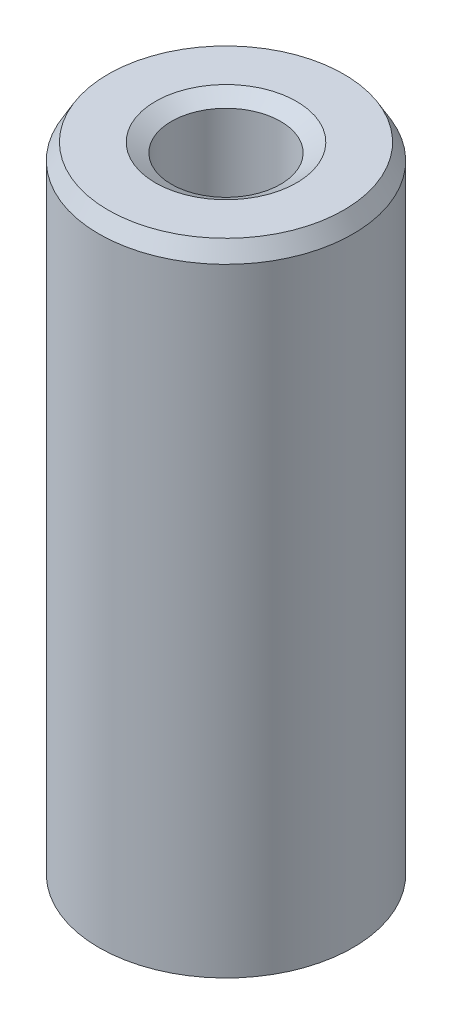
ISO-10303-21;
HEADER;
FILE_DESCRIPTION(('STEP AP214'),'2;1');
FILE_NAME('part.step','',(''),(''),'','','');
FILE_SCHEMA(('AUTOMOTIVE_DESIGN { 1 0 10303 214 1 1 1 1 }'));
ENDSEC;
DATA;
#1=APPLICATION_CONTEXT('core data for automotive mechanical design processes');
#2=APPLICATION_PROTOCOL_DEFINITION('international standard','automotive_design',2000,#1);
#3=PRODUCT_CONTEXT('',#1,'mechanical');
#4=PRODUCT('Part','Part','',(#3));
#5=PRODUCT_RELATED_PRODUCT_CATEGORY('part','',(#4));
#6=PRODUCT_DEFINITION_FORMATION('','',#4);
#7=PRODUCT_DEFINITION_CONTEXT('part definition',#1,'design');
#8=PRODUCT_DEFINITION('design','',#6,#7);
#9=PRODUCT_DEFINITION_SHAPE('','',#8);
#10=(LENGTH_UNIT() NAMED_UNIT(*) SI_UNIT(.MILLI.,.METRE.));
#11=(NAMED_UNIT(*) PLANE_ANGLE_UNIT() SI_UNIT($,.RADIAN.));
#12=(NAMED_UNIT(*) SI_UNIT($,.STERADIAN.) SOLID_ANGLE_UNIT());
#13=UNCERTAINTY_MEASURE_WITH_UNIT(LENGTH_MEASURE(1.E-05),#10,'distance_accuracy_value','');
#14=(GEOMETRIC_REPRESENTATION_CONTEXT(3) GLOBAL_UNCERTAINTY_ASSIGNED_CONTEXT((#13)) GLOBAL_UNIT_ASSIGNED_CONTEXT((#10,
#11,#12)) REPRESENTATION_CONTEXT('',''));
#15=CARTESIAN_POINT('',(0.,0.,0.));
#16=DIRECTION('',(0.,0.,1.));
#17=DIRECTION('',(1.,0.,0.));
#18=AXIS2_PLACEMENT_3D('',#15,#16,#17);
#19=CARTESIAN_POINT('',(0.,101.258589536283,0.));
#20=DIRECTION('',(0.,-1.,0.));
#21=DIRECTION('',(0.,0.,-1.));
#22=AXIS2_PLACEMENT_3D('',#19,#20,#21);
#23=CYLINDRICAL_SURFACE('',#22,20.);
#24=CARTESIAN_POINT('',(0.,1.45681187921248,0.));
#25=DIRECTION('',(0.,1.,0.));
#26=DIRECTION('',(0.,0.,1.));
#27=AXIS2_PLACEMENT_3D('',#24,#25,#26);
#28=CIRCLE('',#27,20.);
#29=CARTESIAN_POINT('',(0.,1.45681187921248,20.));
#30=VERTEX_POINT('',#29);
#31=EDGE_CURVE('E10',#30,#30,#28,.T.);
#32=ORIENTED_EDGE('',*,*,#31,.T.);
#33=EDGE_LOOP('',(#32));
#34=FACE_BOUND('',#33,.T.);
#35=CARTESIAN_POINT('',(0.,98.7353173444171,0.));
#36=DIRECTION('',(0.,1.,0.));
#37=DIRECTION('',(0.,0.,1.));
#38=AXIS2_PLACEMENT_3D('',#35,#36,#37);
#39=CIRCLE('',#38,20.);
#40=CARTESIAN_POINT('',(0.,98.7353173444171,20.));
#41=VERTEX_POINT('',#40);
#42=EDGE_CURVE('E50',#41,#41,#39,.F.);
#43=ORIENTED_EDGE('',*,*,#42,.T.);
#44=EDGE_LOOP('',(#43));
#45=FACE_BOUND('',#44,.T.);
#46=ADVANCED_FACE('F39',(#34,#45),#23,.T.);
#47=CARTESIAN_POINT('',(0.,101.258589536283,0.));
#48=DIRECTION('',(0.,1.,0.));
#49=DIRECTION('',(0.,0.,1.));
#50=AXIS2_PLACEMENT_3D('',#47,#48,#49);
#51=PLANE('',#50);
#52=CARTESIAN_POINT('',(0.,101.258589536283,0.));
#53=DIRECTION('',(0.,1.,0.));
#54=DIRECTION('',(0.,0.,1.));
#55=AXIS2_PLACEMENT_3D('',#52,#53,#54);
#56=CIRCLE('',#55,11.1127783671969);
#57=CARTESIAN_POINT('',(0.,101.258589536283,11.1127783671969));
#58=VERTEX_POINT('',#57);
#59=EDGE_CURVE('E58',#58,#58,#56,.F.);
#60=ORIENTED_EDGE('',*,*,#59,.T.);
#61=EDGE_LOOP('',(#60));
#62=FACE_BOUND('',#61,.T.);
#63=CARTESIAN_POINT('',(0.,101.258589536283,0.));
#64=DIRECTION('',(0.,1.,0.));
#65=DIRECTION('',(0.,0.,1.));
#66=AXIS2_PLACEMENT_3D('',#63,#64,#65);
#67=CIRCLE('',#66,18.5431881207875);
#68=CARTESIAN_POINT('',(0.,101.258589536283,18.5431881207875));
#69=VERTEX_POINT('',#68);
#70=EDGE_CURVE('E61',#69,#69,#67,.T.);
#71=ORIENTED_EDGE('',*,*,#70,.T.);
#72=EDGE_LOOP('',(#71));
#73=FACE_BOUND('',#72,.T.);
#74=ADVANCED_FACE('F88',(#62,#73),#51,.T.);
#75=CARTESIAN_POINT('',(0.,0.,0.));
#76=DIRECTION('',(0.,1.,0.));
#77=DIRECTION('',(0.,0.,1.));
#78=AXIS2_PLACEMENT_3D('',#75,#76,#77);
#79=PLANE('',#78);
#80=CARTESIAN_POINT('',(0.,0.,0.));
#81=DIRECTION('',(0.,1.,0.));
#82=DIRECTION('',(0.,0.,1.));
#83=AXIS2_PLACEMENT_3D('',#80,#81,#82);
#84=CIRCLE('',#83,10.0463180545435);
#85=CARTESIAN_POINT('',(0.,0.,10.0463180545435));
#86=VERTEX_POINT('',#85);
#87=EDGE_CURVE('E51',#86,#86,#84,.T.);
#88=ORIENTED_EDGE('',*,*,#87,.T.);
#89=EDGE_LOOP('',(#88));
#90=FACE_BOUND('',#89,.T.);
#91=CARTESIAN_POINT('',(0.,0.,0.));
#92=DIRECTION('',(0.,1.,0.));
#93=DIRECTION('',(0.,0.,1.));
#94=AXIS2_PLACEMENT_3D('',#91,#92,#93);
#95=CIRCLE('',#94,17.4767278081341);
#96=CARTESIAN_POINT('',(0.,0.,17.4767278081341));
#97=VERTEX_POINT('',#96);
#98=EDGE_CURVE('E54',#97,#97,#95,.F.);
#99=ORIENTED_EDGE('',*,*,#98,.T.);
#100=EDGE_LOOP('',(#99));
#101=FACE_BOUND('',#100,.T.);
#102=ADVANCED_FACE('F83',(#90,#101),#79,.F.);
#103=CARTESIAN_POINT('',(0.,101.258589536283,0.));
#104=DIRECTION('',(0.,-1.,0.));
#105=DIRECTION('',(0.,0.,-1.));
#106=AXIS2_PLACEMENT_3D('',#103,#104,#105);
#107=CYLINDRICAL_SURFACE('',#106,8.58950617533101);
#108=CARTESIAN_POINT('',(0.,99.8017776570705,0.));
#109=DIRECTION('',(0.,1.,0.));
#110=DIRECTION('',(0.,0.,1.));
#111=AXIS2_PLACEMENT_3D('',#108,#109,#110);
#112=CIRCLE('',#111,8.58950617533101);
#113=CARTESIAN_POINT('',(0.,99.8017776570705,8.58950617533101));
#114=VERTEX_POINT('',#113);
#115=EDGE_CURVE('E67',#114,#114,#112,.T.);
#116=ORIENTED_EDGE('',*,*,#115,.T.);
#117=EDGE_LOOP('',(#116));
#118=FACE_BOUND('',#117,.T.);
#119=CARTESIAN_POINT('',(0.,2.52327219186592,0.));
#120=DIRECTION('',(0.,1.,0.));
#121=DIRECTION('',(0.,0.,1.));
#122=AXIS2_PLACEMENT_3D('',#119,#120,#121);
#123=CIRCLE('',#122,8.58950617533101);
#124=CARTESIAN_POINT('',(0.,2.52327219186592,8.58950617533101));
#125=VERTEX_POINT('',#124);
#126=EDGE_CURVE('E69',#125,#125,#123,.F.);
#127=ORIENTED_EDGE('',*,*,#126,.T.);
#128=EDGE_LOOP('',(#127));
#129=FACE_BOUND('',#128,.T.);
#130=ADVANCED_FACE('F71',(#118,#129),#107,.F.);
#131=CARTESIAN_POINT('',(0.,99.8017776570705,0.));
#132=DIRECTION('',(0.,1.,0.));
#133=DIRECTION('',(0.,0.,1.));
#134=AXIS2_PLACEMENT_3D('',#131,#132,#133);
#135=CONICAL_SURFACE('',#134,8.58950617533101,1.04719755119661);
#136=ORIENTED_EDGE('',*,*,#59,.F.);
#137=EDGE_LOOP('',(#136));
#138=FACE_BOUND('',#137,.T.);
#139=ORIENTED_EDGE('',*,*,#115,.F.);
#140=EDGE_LOOP('',(#139));
#141=FACE_BOUND('',#140,.T.);
#142=ADVANCED_FACE('F77',(#138,#141),#135,.F.);
#143=CARTESIAN_POINT('',(0.,0.,0.));
#144=DIRECTION('',(0.,-1.,0.));
#145=DIRECTION('',(0.,0.,-1.));
#146=AXIS2_PLACEMENT_3D('',#143,#144,#145);
#147=CONICAL_SURFACE('',#146,10.0463180545435,0.523598775598295);
#148=ORIENTED_EDGE('',*,*,#126,.F.);
#149=EDGE_LOOP('',(#148));
#150=FACE_BOUND('',#149,.T.);
#151=ORIENTED_EDGE('',*,*,#87,.F.);
#152=EDGE_LOOP('',(#151));
#153=FACE_BOUND('',#152,.T.);
#154=ADVANCED_FACE('F73',(#150,#153),#147,.F.);
#155=CARTESIAN_POINT('',(0.,1.45681187921248,0.));
#156=DIRECTION('',(0.,1.,0.));
#157=DIRECTION('',(0.,0.,1.));
#158=AXIS2_PLACEMENT_3D('',#155,#156,#157);
#159=CONICAL_SURFACE('',#158,20.,1.0471975511966);
#160=ORIENTED_EDGE('',*,*,#98,.F.);
#161=EDGE_LOOP('',(#160));
#162=FACE_BOUND('',#161,.T.);
#163=ORIENTED_EDGE('',*,*,#31,.F.);
#164=EDGE_LOOP('',(#163));
#165=FACE_BOUND('',#164,.T.);
#166=ADVANCED_FACE('F76',(#162,#165),#159,.T.);
#167=CARTESIAN_POINT('',(0.,101.258589536283,0.));
#168=DIRECTION('',(0.,-1.,0.));
#169=DIRECTION('',(0.,0.,-1.));
#170=AXIS2_PLACEMENT_3D('',#167,#168,#169);
#171=CONICAL_SURFACE('',#170,18.5431881207875,0.523598775598298);
#172=ORIENTED_EDGE('',*,*,#42,.F.);
#173=EDGE_LOOP('',(#172));
#174=FACE_BOUND('',#173,.T.);
#175=ORIENTED_EDGE('',*,*,#70,.F.);
#176=EDGE_LOOP('',(#175));
#177=FACE_BOUND('',#176,.T.);
#178=ADVANCED_FACE('F45',(#174,#177),#171,.T.);
#179=CLOSED_SHELL('',(#46,#74,#102,#130,#142,#154,#166,#178));
#180=MANIFOLD_SOLID_BREP('B2',#179);
#181=ADVANCED_BREP_SHAPE_REPRESENTATION('',(#18,#180),#14);
#182=SHAPE_DEFINITION_REPRESENTATION(#9,#181);
ENDSEC;
END-ISO-10303-21;
